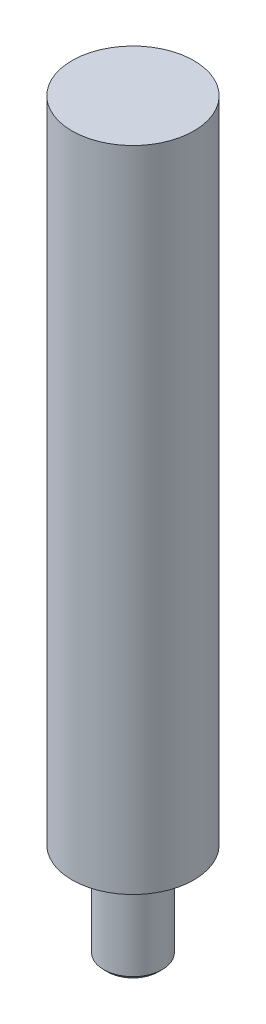
ISO-10303-21;
HEADER;
FILE_DESCRIPTION(('STEP AP214'),'2;1');
FILE_NAME('part.step','',(''),(''),'','','');
FILE_SCHEMA(('AUTOMOTIVE_DESIGN { 1 0 10303 214 1 1 1 1 }'));
ENDSEC;
DATA;
#1=APPLICATION_CONTEXT('core data for automotive mechanical design processes');
#2=APPLICATION_PROTOCOL_DEFINITION('international standard','automotive_design',2000,#1);
#3=PRODUCT_CONTEXT('',#1,'mechanical');
#4=PRODUCT('Part','Part','',(#3));
#5=PRODUCT_RELATED_PRODUCT_CATEGORY('part','',(#4));
#6=PRODUCT_DEFINITION_FORMATION('','',#4);
#7=PRODUCT_DEFINITION_CONTEXT('part definition',#1,'design');
#8=PRODUCT_DEFINITION('design','',#6,#7);
#9=PRODUCT_DEFINITION_SHAPE('','',#8);
#10=(LENGTH_UNIT() NAMED_UNIT(*) SI_UNIT(.MILLI.,.METRE.));
#11=(NAMED_UNIT(*) PLANE_ANGLE_UNIT() SI_UNIT($,.RADIAN.));
#12=(NAMED_UNIT(*) SI_UNIT($,.STERADIAN.) SOLID_ANGLE_UNIT());
#13=UNCERTAINTY_MEASURE_WITH_UNIT(LENGTH_MEASURE(1.E-05),#10,'distance_accuracy_value','');
#14=(GEOMETRIC_REPRESENTATION_CONTEXT(3) GLOBAL_UNCERTAINTY_ASSIGNED_CONTEXT((#13)) GLOBAL_UNIT_ASSIGNED_CONTEXT((#10,
#11,#12)) REPRESENTATION_CONTEXT('',''));
#15=CARTESIAN_POINT('',(0.,0.,0.));
#16=DIRECTION('',(0.,0.,1.));
#17=DIRECTION('',(1.,0.,0.));
#18=AXIS2_PLACEMENT_3D('',#15,#16,#17);
#19=CARTESIAN_POINT('',(0.,133.,0.));
#20=DIRECTION('',(0.,-1.,0.));
#21=DIRECTION('',(0.,0.,-1.));
#22=AXIS2_PLACEMENT_3D('',#19,#20,#21);
#23=CYLINDRICAL_SURFACE('',#22,12.5);
#24=CARTESIAN_POINT('',(0.,133.,0.));
#25=DIRECTION('',(0.,1.,0.));
#26=DIRECTION('',(0.,0.,1.));
#27=AXIS2_PLACEMENT_3D('',#24,#25,#26);
#28=CIRCLE('',#27,12.5);
#29=CARTESIAN_POINT('',(0.,133.,12.5));
#30=VERTEX_POINT('',#29);
#31=EDGE_CURVE('E10',#30,#30,#28,.T.);
#32=ORIENTED_EDGE('',*,*,#31,.F.);
#33=EDGE_LOOP('',(#32));
#34=FACE_BOUND('',#33,.T.);
#35=CARTESIAN_POINT('',(0.,0.,0.));
#36=DIRECTION('',(0.,1.,0.));
#37=DIRECTION('',(0.,0.,1.));
#38=AXIS2_PLACEMENT_3D('',#35,#36,#37);
#39=CIRCLE('',#38,12.5);
#40=CARTESIAN_POINT('',(0.,0.,12.5));
#41=VERTEX_POINT('',#40);
#42=EDGE_CURVE('E39',#41,#41,#39,.T.);
#43=ORIENTED_EDGE('',*,*,#42,.T.);
#44=EDGE_LOOP('',(#43));
#45=FACE_BOUND('',#44,.T.);
#46=ADVANCED_FACE('F36',(#34,#45),#23,.T.);
#47=CARTESIAN_POINT('',(0.,133.,0.));
#48=DIRECTION('',(0.,1.,0.));
#49=DIRECTION('',(0.,0.,1.));
#50=AXIS2_PLACEMENT_3D('',#47,#48,#49);
#51=PLANE('',#50);
#52=ORIENTED_EDGE('',*,*,#31,.T.);
#53=EDGE_LOOP('',(#52));
#54=FACE_BOUND('',#53,.T.);
#55=ADVANCED_FACE('F73',(#54),#51,.T.);
#56=CARTESIAN_POINT('',(0.,0.,0.));
#57=DIRECTION('',(0.,1.,0.));
#58=DIRECTION('',(0.,0.,1.));
#59=AXIS2_PLACEMENT_3D('',#56,#57,#58);
#60=PLANE('',#59);
#61=ORIENTED_EDGE('',*,*,#42,.F.);
#62=EDGE_LOOP('',(#61));
#63=FACE_BOUND('',#62,.T.);
#64=CARTESIAN_POINT('',(0.,0.,0.));
#65=DIRECTION('',(0.,1.,0.));
#66=DIRECTION('',(0.,0.,1.));
#67=AXIS2_PLACEMENT_3D('',#64,#65,#66);
#68=CIRCLE('',#67,6.);
#69=CARTESIAN_POINT('',(0.,0.,6.));
#70=VERTEX_POINT('',#69);
#71=EDGE_CURVE('E46',#70,#70,#68,.T.);
#72=ORIENTED_EDGE('',*,*,#71,.T.);
#73=EDGE_LOOP('',(#72));
#74=FACE_BOUND('',#73,.T.);
#75=ADVANCED_FACE('F78',(#63,#74),#60,.F.);
#76=CARTESIAN_POINT('',(0.,-20.,0.));
#77=DIRECTION('',(0.,1.,0.));
#78=DIRECTION('',(0.,0.,1.));
#79=AXIS2_PLACEMENT_3D('',#76,#77,#78);
#80=CYLINDRICAL_SURFACE('',#79,6.);
#81=ORIENTED_EDGE('',*,*,#71,.F.);
#82=EDGE_LOOP('',(#81));
#83=FACE_BOUND('',#82,.T.);
#84=CARTESIAN_POINT('',(0.,-19.172,0.));
#85=DIRECTION('',(0.,1.,0.));
#86=DIRECTION('',(0.,0.,1.));
#87=AXIS2_PLACEMENT_3D('',#84,#85,#86);
#88=CIRCLE('',#87,6.);
#89=CARTESIAN_POINT('',(0.,-19.172,6.));
#90=VERTEX_POINT('',#89);
#91=EDGE_CURVE('E53',#90,#90,#88,.T.);
#92=ORIENTED_EDGE('',*,*,#91,.T.);
#93=EDGE_LOOP('',(#92));
#94=FACE_BOUND('',#93,.T.);
#95=ADVANCED_FACE('F57',(#83,#94),#80,.T.);
#96=CARTESIAN_POINT('',(0.,-20.,0.));
#97=DIRECTION('',(0.,1.,0.));
#98=DIRECTION('',(0.,0.,1.));
#99=AXIS2_PLACEMENT_3D('',#96,#97,#98);
#100=CONICAL_SURFACE('',#99,5.172,0.785398163397455);
#101=ORIENTED_EDGE('',*,*,#91,.F.);
#102=EDGE_LOOP('',(#101));
#103=FACE_BOUND('',#102,.T.);
#104=CARTESIAN_POINT('',(0.,-20.,0.));
#105=DIRECTION('',(0.,1.,0.));
#106=DIRECTION('',(0.,0.,1.));
#107=AXIS2_PLACEMENT_3D('',#104,#105,#106);
#108=CIRCLE('',#107,5.172);
#109=CARTESIAN_POINT('',(0.,-20.,5.172));
#110=VERTEX_POINT('',#109);
#111=EDGE_CURVE('E50',#110,#110,#108,.T.);
#112=ORIENTED_EDGE('',*,*,#111,.T.);
#113=EDGE_LOOP('',(#112));
#114=FACE_BOUND('',#113,.T.);
#115=ADVANCED_FACE('F59',(#103,#114),#100,.T.);
#116=CARTESIAN_POINT('',(0.,-20.,0.));
#117=DIRECTION('',(0.,-1.,0.));
#118=DIRECTION('',(0.,0.,-1.));
#119=AXIS2_PLACEMENT_3D('',#116,#117,#118);
#120=PLANE('',#119);
#121=ORIENTED_EDGE('',*,*,#111,.F.);
#122=EDGE_LOOP('',(#121));
#123=FACE_BOUND('',#122,.T.);
#124=ADVANCED_FACE('F62',(#123),#120,.T.);
#125=CLOSED_SHELL('',(#46,#55,#75,#95,#115,#124));
#126=MANIFOLD_SOLID_BREP('B2',#125);
#127=ADVANCED_BREP_SHAPE_REPRESENTATION('',(#18,#126),#14);
#128=SHAPE_DEFINITION_REPRESENTATION(#9,#127);
ENDSEC;
END-ISO-10303-21;
